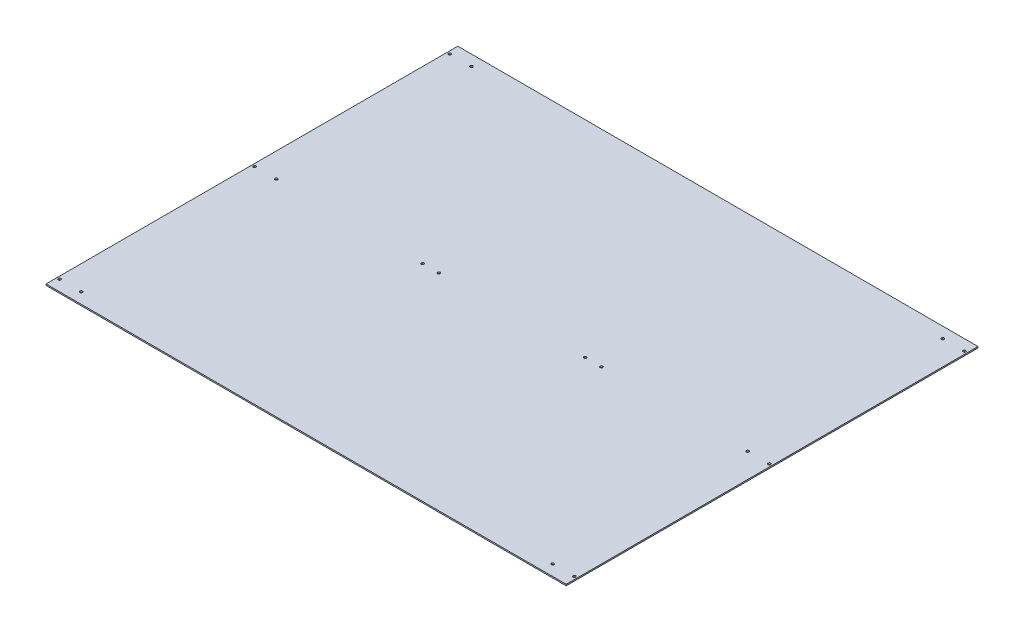
ISO-10303-21;
HEADER;
FILE_DESCRIPTION(('STEP AP214'),'2;1');
FILE_NAME('part.step','',(''),(''),'','','');
FILE_SCHEMA(('AUTOMOTIVE_DESIGN { 1 0 10303 214 1 1 1 1 }'));
ENDSEC;
DATA;
#1=APPLICATION_CONTEXT('core data for automotive mechanical design processes');
#2=APPLICATION_PROTOCOL_DEFINITION('international standard','automotive_design',2000,#1);
#3=PRODUCT_CONTEXT('',#1,'mechanical');
#4=PRODUCT('Part','Part','',(#3));
#5=PRODUCT_RELATED_PRODUCT_CATEGORY('part','',(#4));
#6=PRODUCT_DEFINITION_FORMATION('','',#4);
#7=PRODUCT_DEFINITION_CONTEXT('part definition',#1,'design');
#8=PRODUCT_DEFINITION('design','',#6,#7);
#9=PRODUCT_DEFINITION_SHAPE('','',#8);
#10=(LENGTH_UNIT() NAMED_UNIT(*) SI_UNIT(.MILLI.,.METRE.));
#11=(NAMED_UNIT(*) PLANE_ANGLE_UNIT() SI_UNIT($,.RADIAN.));
#12=(NAMED_UNIT(*) SI_UNIT($,.STERADIAN.) SOLID_ANGLE_UNIT());
#13=UNCERTAINTY_MEASURE_WITH_UNIT(LENGTH_MEASURE(1.E-05),#10,'distance_accuracy_value','');
#14=(GEOMETRIC_REPRESENTATION_CONTEXT(3) GLOBAL_UNCERTAINTY_ASSIGNED_CONTEXT((#13)) GLOBAL_UNIT_ASSIGNED_CONTEXT((#10,
#11,#12)) REPRESENTATION_CONTEXT('',''));
#15=CARTESIAN_POINT('',(0.,0.,0.));
#16=DIRECTION('',(0.,0.,1.));
#17=DIRECTION('',(1.,0.,0.));
#18=AXIS2_PLACEMENT_3D('',#15,#16,#17);
#19=CARTESIAN_POINT('',(0.,-19.05,873.125));
#20=DIRECTION('',(0.,1.,0.));
#21=DIRECTION('',(0.,0.,1.));
#22=AXIS2_PLACEMENT_3D('',#19,#20,#21);
#23=PLANE('',#22);
#24=CARTESIAN_POINT('',(171.45,-19.05,876.3));
#25=DIRECTION('',(0.,1.,0.));
#26=DIRECTION('',(0.,0.,1.));
#27=AXIS2_PLACEMENT_3D('',#24,#25,#26);
#28=CIRCLE('',#27,3.175);
#29=CARTESIAN_POINT('',(171.45,-19.05,879.475));
#30=VERTEX_POINT('',#29);
#31=EDGE_CURVE('E20',#30,#30,#28,.F.);
#32=ORIENTED_EDGE('',*,*,#31,.T.);
#33=EDGE_LOOP('',(#32));
#34=FACE_BOUND('',#33,.T.);
#35=CARTESIAN_POINT('',(-603.25,-19.05,876.3));
#36=DIRECTION('',(0.,-1.,0.));
#37=DIRECTION('',(0.,0.,-1.));
#38=AXIS2_PLACEMENT_3D('',#35,#36,#37);
#39=CIRCLE('',#38,3.175);
#40=CARTESIAN_POINT('',(-603.25,-19.05,873.125));
#41=VERTEX_POINT('',#40);
#42=EDGE_CURVE('E156',#41,#41,#39,.T.);
#43=ORIENTED_EDGE('',*,*,#42,.T.);
#44=EDGE_LOOP('',(#43));
#45=FACE_BOUND('',#44,.T.);
#46=CARTESIAN_POINT('',(-552.45,-19.05,1333.5));
#47=DIRECTION('',(0.,-1.,0.));
#48=DIRECTION('',(0.,0.,-1.));
#49=AXIS2_PLACEMENT_3D('',#46,#47,#48);
#50=CIRCLE('',#49,3.175);
#51=CARTESIAN_POINT('',(-552.45,-19.05,1330.325));
#52=VERTEX_POINT('',#51);
#53=EDGE_CURVE('E168',#52,#52,#50,.T.);
#54=ORIENTED_EDGE('',*,*,#53,.T.);
#55=EDGE_LOOP('',(#54));
#56=FACE_BOUND('',#55,.T.);
#57=CARTESIAN_POINT('',(552.45,-19.05,419.1));
#58=DIRECTION('',(0.,-1.,0.));
#59=DIRECTION('',(0.,0.,-1.));
#60=AXIS2_PLACEMENT_3D('',#57,#58,#59);
#61=CIRCLE('',#60,3.175);
#62=CARTESIAN_POINT('',(552.45,-19.05,415.925));
#63=VERTEX_POINT('',#62);
#64=EDGE_CURVE('E175',#63,#63,#61,.T.);
#65=ORIENTED_EDGE('',*,*,#64,.T.);
#66=EDGE_LOOP('',(#65));
#67=FACE_BOUND('',#66,.T.);
#68=CARTESIAN_POINT('',(552.45,-19.05,876.3));
#69=DIRECTION('',(0.,-1.,0.));
#70=DIRECTION('',(0.,0.,-1.));
#71=AXIS2_PLACEMENT_3D('',#68,#69,#70);
#72=CIRCLE('',#71,3.175);
#73=CARTESIAN_POINT('',(552.45,-19.05,873.125));
#74=VERTEX_POINT('',#73);
#75=EDGE_CURVE('E208',#74,#74,#72,.T.);
#76=ORIENTED_EDGE('',*,*,#75,.T.);
#77=EDGE_LOOP('',(#76));
#78=FACE_BOUND('',#77,.T.);
#79=CARTESIAN_POINT('',(603.25,-19.05,876.3));
#80=DIRECTION('',(0.,-1.,0.));
#81=DIRECTION('',(0.,0.,-1.));
#82=AXIS2_PLACEMENT_3D('',#79,#80,#81);
#83=CIRCLE('',#82,3.175);
#84=CARTESIAN_POINT('',(603.25,-19.05,873.125));
#85=VERTEX_POINT('',#84);
#86=EDGE_CURVE('E204',#85,#85,#83,.T.);
#87=ORIENTED_EDGE('',*,*,#86,.T.);
#88=EDGE_LOOP('',(#87));
#89=FACE_BOUND('',#88,.T.);
#90=CARTESIAN_POINT('',(603.25,-19.05,1333.5));
#91=DIRECTION('',(0.,-1.,0.));
#92=DIRECTION('',(0.,0.,-1.));
#93=AXIS2_PLACEMENT_3D('',#90,#91,#92);
#94=CIRCLE('',#93,3.175);
#95=CARTESIAN_POINT('',(603.25,-19.05,1330.325));
#96=VERTEX_POINT('',#95);
#97=EDGE_CURVE('E201',#96,#96,#94,.T.);
#98=ORIENTED_EDGE('',*,*,#97,.T.);
#99=EDGE_LOOP('',(#98));
#100=FACE_BOUND('',#99,.T.);
#101=CARTESIAN_POINT('',(-552.45,-19.05,419.1));
#102=DIRECTION('',(0.,-1.,0.));
#103=DIRECTION('',(0.,0.,-1.));
#104=AXIS2_PLACEMENT_3D('',#101,#102,#103);
#105=CIRCLE('',#104,3.175);
#106=CARTESIAN_POINT('',(-552.45,-19.05,415.925));
#107=VERTEX_POINT('',#106);
#108=EDGE_CURVE('E194',#107,#107,#105,.T.);
#109=ORIENTED_EDGE('',*,*,#108,.T.);
#110=EDGE_LOOP('',(#109));
#111=FACE_BOUND('',#110,.T.);
#112=CARTESIAN_POINT('',(-603.25,-19.05,419.1));
#113=DIRECTION('',(0.,-1.,0.));
#114=DIRECTION('',(0.,0.,-1.));
#115=AXIS2_PLACEMENT_3D('',#112,#113,#114);
#116=CIRCLE('',#115,3.175);
#117=CARTESIAN_POINT('',(-603.25,-19.05,415.925));
#118=VERTEX_POINT('',#117);
#119=EDGE_CURVE('E190',#118,#118,#116,.T.);
#120=ORIENTED_EDGE('',*,*,#119,.T.);
#121=EDGE_LOOP('',(#120));
#122=FACE_BOUND('',#121,.T.);
#123=DIRECTION('',(0.,0.,1.));
#124=VECTOR('',#123,1.);
#125=CARTESIAN_POINT('',(-609.6,-19.05,838.2));
#126=LINE('',#125,#124);
#127=CARTESIAN_POINT('',(-609.6,-19.05,1358.9));
#128=VERTEX_POINT('',#127);
#129=CARTESIAN_POINT('',(-609.6,-19.05,393.7));
#130=VERTEX_POINT('',#129);
#131=EDGE_CURVE('E59',#128,#130,#126,.F.);
#132=ORIENTED_EDGE('',*,*,#131,.F.);
#133=DIRECTION('',(1.,0.,0.));
#134=VECTOR('',#133,1.);
#135=CARTESIAN_POINT('',(609.6,-19.05,1358.9));
#136=LINE('',#135,#134);
#137=CARTESIAN_POINT('',(609.6,-19.05,1358.9));
#138=VERTEX_POINT('',#137);
#139=EDGE_CURVE('E54',#138,#128,#136,.F.);
#140=ORIENTED_EDGE('',*,*,#139,.F.);
#141=DIRECTION('',(0.,0.,1.));
#142=VECTOR('',#141,1.);
#143=CARTESIAN_POINT('',(609.6,-19.05,838.2));
#144=LINE('',#143,#142);
#145=CARTESIAN_POINT('',(609.6,-19.05,393.7));
#146=VERTEX_POINT('',#145);
#147=EDGE_CURVE('E72',#138,#146,#144,.F.);
#148=ORIENTED_EDGE('',*,*,#147,.T.);
#149=DIRECTION('',(-1.,0.,0.));
#150=VECTOR('',#149,1.);
#151=CARTESIAN_POINT('',(410.172683035578,-19.05,393.7));
#152=LINE('',#151,#150);
#153=EDGE_CURVE('E68',#130,#146,#152,.F.);
#154=ORIENTED_EDGE('',*,*,#153,.F.);
#155=EDGE_LOOP('',(#132,#140,#148,#154));
#156=FACE_BOUND('',#155,.T.);
#157=CARTESIAN_POINT('',(552.45,-19.05,1333.5));
#158=DIRECTION('',(0.,-1.,0.));
#159=DIRECTION('',(0.,0.,-1.));
#160=AXIS2_PLACEMENT_3D('',#157,#158,#159);
#161=CIRCLE('',#160,3.175);
#162=CARTESIAN_POINT('',(552.45,-19.05,1330.325));
#163=VERTEX_POINT('',#162);
#164=EDGE_CURVE('E76',#163,#163,#161,.T.);
#165=ORIENTED_EDGE('',*,*,#164,.T.);
#166=EDGE_LOOP('',(#165));
#167=FACE_BOUND('',#166,.T.);
#168=CARTESIAN_POINT('',(-552.45,-19.05,876.3));
#169=DIRECTION('',(0.,-1.,0.));
#170=DIRECTION('',(0.,0.,-1.));
#171=AXIS2_PLACEMENT_3D('',#168,#169,#170);
#172=CIRCLE('',#171,3.175);
#173=CARTESIAN_POINT('',(-552.45,-19.05,873.125));
#174=VERTEX_POINT('',#173);
#175=EDGE_CURVE('E183',#174,#174,#172,.T.);
#176=ORIENTED_EDGE('',*,*,#175,.T.);
#177=EDGE_LOOP('',(#176));
#178=FACE_BOUND('',#177,.T.);
#179=CARTESIAN_POINT('',(603.25,-19.05,419.1));
#180=DIRECTION('',(0.,-1.,0.));
#181=DIRECTION('',(0.,0.,-1.));
#182=AXIS2_PLACEMENT_3D('',#179,#180,#181);
#183=CIRCLE('',#182,3.175);
#184=CARTESIAN_POINT('',(603.25,-19.05,415.925));
#185=VERTEX_POINT('',#184);
#186=EDGE_CURVE('E172',#185,#185,#183,.T.);
#187=ORIENTED_EDGE('',*,*,#186,.T.);
#188=EDGE_LOOP('',(#187));
#189=FACE_BOUND('',#188,.T.);
#190=CARTESIAN_POINT('',(-603.25,-19.05,1333.5));
#191=DIRECTION('',(0.,-1.,0.));
#192=DIRECTION('',(0.,0.,-1.));
#193=AXIS2_PLACEMENT_3D('',#190,#191,#192);
#194=CIRCLE('',#193,3.175);
#195=CARTESIAN_POINT('',(-603.25,-19.05,1330.325));
#196=VERTEX_POINT('',#195);
#197=EDGE_CURVE('E160',#196,#196,#194,.T.);
#198=ORIENTED_EDGE('',*,*,#197,.T.);
#199=EDGE_LOOP('',(#198));
#200=FACE_BOUND('',#199,.T.);
#201=CARTESIAN_POINT('',(-209.55,-19.05,876.3));
#202=DIRECTION('',(0.,1.,0.));
#203=DIRECTION('',(0.,0.,1.));
#204=AXIS2_PLACEMENT_3D('',#201,#202,#203);
#205=CIRCLE('',#204,3.175);
#206=CARTESIAN_POINT('',(-209.55,-19.05,879.475));
#207=VERTEX_POINT('',#206);
#208=EDGE_CURVE('E153',#207,#207,#205,.F.);
#209=ORIENTED_EDGE('',*,*,#208,.T.);
#210=EDGE_LOOP('',(#209));
#211=FACE_BOUND('',#210,.T.);
#212=CARTESIAN_POINT('',(-171.45,-19.05,876.3));
#213=DIRECTION('',(0.,1.,0.));
#214=DIRECTION('',(0.,0.,1.));
#215=AXIS2_PLACEMENT_3D('',#212,#213,#214);
#216=CIRCLE('',#215,3.175);
#217=CARTESIAN_POINT('',(-171.45,-19.05,879.475));
#218=VERTEX_POINT('',#217);
#219=EDGE_CURVE('E150',#218,#218,#216,.F.);
#220=ORIENTED_EDGE('',*,*,#219,.T.);
#221=EDGE_LOOP('',(#220));
#222=FACE_BOUND('',#221,.T.);
#223=CARTESIAN_POINT('',(209.55,-19.05,876.3));
#224=DIRECTION('',(0.,1.,0.));
#225=DIRECTION('',(0.,0.,1.));
#226=AXIS2_PLACEMENT_3D('',#223,#224,#225);
#227=CIRCLE('',#226,3.175);
#228=CARTESIAN_POINT('',(209.55,-19.05,879.475));
#229=VERTEX_POINT('',#228);
#230=EDGE_CURVE('E211',#229,#229,#227,.F.);
#231=ORIENTED_EDGE('',*,*,#230,.T.);
#232=EDGE_LOOP('',(#231));
#233=FACE_BOUND('',#232,.T.);
#234=ADVANCED_FACE('F17',(#34,#45,#56,#67,#78,#89,#100,#111,#122,#156,#167,#178,#189,#200,#211,
#222,#233),#23,.T.);
#235=CARTESIAN_POINT('',(171.45,3.175,876.3));
#236=DIRECTION('',(0.,1.,0.));
#237=DIRECTION('',(0.,0.,1.));
#238=AXIS2_PLACEMENT_3D('',#235,#236,#237);
#239=CYLINDRICAL_SURFACE('',#238,3.175);
#240=CARTESIAN_POINT('',(171.45,-22.225,876.3));
#241=DIRECTION('',(0.,1.,0.));
#242=DIRECTION('',(0.,0.,1.));
#243=AXIS2_PLACEMENT_3D('',#240,#241,#242);
#244=CIRCLE('',#243,3.175);
#245=CARTESIAN_POINT('',(171.45,-22.225,879.475));
#246=VERTEX_POINT('',#245);
#247=EDGE_CURVE('E147',#246,#246,#244,.F.);
#248=ORIENTED_EDGE('',*,*,#247,.T.);
#249=EDGE_LOOP('',(#248));
#250=FACE_BOUND('',#249,.T.);
#251=ORIENTED_EDGE('',*,*,#31,.F.);
#252=EDGE_LOOP('',(#251));
#253=FACE_BOUND('',#252,.T.);
#254=ADVANCED_FACE('F220',(#250,#253),#239,.F.);
#255=CARTESIAN_POINT('',(209.55,3.175,876.3));
#256=DIRECTION('',(0.,1.,0.));
#257=DIRECTION('',(0.,0.,1.));
#258=AXIS2_PLACEMENT_3D('',#255,#256,#257);
#259=CYLINDRICAL_SURFACE('',#258,3.175);
#260=CARTESIAN_POINT('',(209.55,-22.225,876.3));
#261=DIRECTION('',(0.,1.,0.));
#262=DIRECTION('',(0.,0.,1.));
#263=AXIS2_PLACEMENT_3D('',#260,#261,#262);
#264=CIRCLE('',#263,3.175);
#265=CARTESIAN_POINT('',(209.55,-22.225,879.475));
#266=VERTEX_POINT('',#265);
#267=EDGE_CURVE('E144',#266,#266,#264,.F.);
#268=ORIENTED_EDGE('',*,*,#267,.T.);
#269=EDGE_LOOP('',(#268));
#270=FACE_BOUND('',#269,.T.);
#271=ORIENTED_EDGE('',*,*,#230,.F.);
#272=EDGE_LOOP('',(#271));
#273=FACE_BOUND('',#272,.T.);
#274=ADVANCED_FACE('F222',(#270,#273),#259,.F.);
#275=CARTESIAN_POINT('',(552.45,-44.45,876.3));
#276=DIRECTION('',(0.,-1.,0.));
#277=DIRECTION('',(0.,0.,-1.));
#278=AXIS2_PLACEMENT_3D('',#275,#276,#277);
#279=CYLINDRICAL_SURFACE('',#278,3.175);
#280=CARTESIAN_POINT('',(552.45,-22.225,876.3));
#281=DIRECTION('',(0.,-1.,0.));
#282=DIRECTION('',(0.,0.,-1.));
#283=AXIS2_PLACEMENT_3D('',#280,#281,#282);
#284=CIRCLE('',#283,3.175);
#285=CARTESIAN_POINT('',(552.45,-22.225,873.125));
#286=VERTEX_POINT('',#285);
#287=EDGE_CURVE('E140',#286,#286,#284,.T.);
#288=ORIENTED_EDGE('',*,*,#287,.T.);
#289=EDGE_LOOP('',(#288));
#290=FACE_BOUND('',#289,.T.);
#291=ORIENTED_EDGE('',*,*,#75,.F.);
#292=EDGE_LOOP('',(#291));
#293=FACE_BOUND('',#292,.T.);
#294=ADVANCED_FACE('F229',(#290,#293),#279,.F.);
#295=CARTESIAN_POINT('',(603.25,-44.45,876.3));
#296=DIRECTION('',(0.,-1.,0.));
#297=DIRECTION('',(0.,0.,-1.));
#298=AXIS2_PLACEMENT_3D('',#295,#296,#297);
#299=CYLINDRICAL_SURFACE('',#298,3.175);
#300=CARTESIAN_POINT('',(603.25,-22.225,876.3));
#301=DIRECTION('',(0.,-1.,0.));
#302=DIRECTION('',(0.,0.,-1.));
#303=AXIS2_PLACEMENT_3D('',#300,#301,#302);
#304=CIRCLE('',#303,3.175);
#305=CARTESIAN_POINT('',(603.25,-22.225,873.125));
#306=VERTEX_POINT('',#305);
#307=EDGE_CURVE('E137',#306,#306,#304,.T.);
#308=ORIENTED_EDGE('',*,*,#307,.T.);
#309=EDGE_LOOP('',(#308));
#310=FACE_BOUND('',#309,.T.);
#311=ORIENTED_EDGE('',*,*,#86,.F.);
#312=EDGE_LOOP('',(#311));
#313=FACE_BOUND('',#312,.T.);
#314=ADVANCED_FACE('F298',(#310,#313),#299,.F.);
#315=CARTESIAN_POINT('',(603.25,-44.45,1333.5));
#316=DIRECTION('',(0.,-1.,0.));
#317=DIRECTION('',(0.,0.,-1.));
#318=AXIS2_PLACEMENT_3D('',#315,#316,#317);
#319=CYLINDRICAL_SURFACE('',#318,3.175);
#320=CARTESIAN_POINT('',(603.25,-22.225,1333.5));
#321=DIRECTION('',(0.,-1.,0.));
#322=DIRECTION('',(0.,0.,-1.));
#323=AXIS2_PLACEMENT_3D('',#320,#321,#322);
#324=CIRCLE('',#323,3.175);
#325=CARTESIAN_POINT('',(603.25,-22.225,1330.325));
#326=VERTEX_POINT('',#325);
#327=EDGE_CURVE('E133',#326,#326,#324,.T.);
#328=ORIENTED_EDGE('',*,*,#327,.T.);
#329=EDGE_LOOP('',(#328));
#330=FACE_BOUND('',#329,.T.);
#331=ORIENTED_EDGE('',*,*,#97,.F.);
#332=EDGE_LOOP('',(#331));
#333=FACE_BOUND('',#332,.T.);
#334=ADVANCED_FACE('F294',(#330,#333),#319,.F.);
#335=CARTESIAN_POINT('',(-552.45,-44.45,419.1));
#336=DIRECTION('',(0.,-1.,0.));
#337=DIRECTION('',(0.,0.,-1.));
#338=AXIS2_PLACEMENT_3D('',#335,#336,#337);
#339=CYLINDRICAL_SURFACE('',#338,3.175);
#340=CARTESIAN_POINT('',(-552.45,-22.225,419.1));
#341=DIRECTION('',(0.,-1.,0.));
#342=DIRECTION('',(0.,0.,-1.));
#343=AXIS2_PLACEMENT_3D('',#340,#341,#342);
#344=CIRCLE('',#343,3.175);
#345=CARTESIAN_POINT('',(-552.45,-22.225,415.925));
#346=VERTEX_POINT('',#345);
#347=EDGE_CURVE('E129',#346,#346,#344,.T.);
#348=ORIENTED_EDGE('',*,*,#347,.T.);
#349=EDGE_LOOP('',(#348));
#350=FACE_BOUND('',#349,.T.);
#351=ORIENTED_EDGE('',*,*,#108,.F.);
#352=EDGE_LOOP('',(#351));
#353=FACE_BOUND('',#352,.T.);
#354=ADVANCED_FACE('F290',(#350,#353),#339,.F.);
#355=CARTESIAN_POINT('',(-603.25,-44.45,419.1));
#356=DIRECTION('',(0.,-1.,0.));
#357=DIRECTION('',(0.,0.,-1.));
#358=AXIS2_PLACEMENT_3D('',#355,#356,#357);
#359=CYLINDRICAL_SURFACE('',#358,3.175);
#360=CARTESIAN_POINT('',(-603.25,-22.225,419.1));
#361=DIRECTION('',(0.,-1.,0.));
#362=DIRECTION('',(0.,0.,-1.));
#363=AXIS2_PLACEMENT_3D('',#360,#361,#362);
#364=CIRCLE('',#363,3.175);
#365=CARTESIAN_POINT('',(-603.25,-22.225,415.925));
#366=VERTEX_POINT('',#365);
#367=EDGE_CURVE('E125',#366,#366,#364,.T.);
#368=ORIENTED_EDGE('',*,*,#367,.T.);
#369=EDGE_LOOP('',(#368));
#370=FACE_BOUND('',#369,.T.);
#371=ORIENTED_EDGE('',*,*,#119,.F.);
#372=EDGE_LOOP('',(#371));
#373=FACE_BOUND('',#372,.T.);
#374=ADVANCED_FACE('F286',(#370,#373),#359,.F.);
#375=CARTESIAN_POINT('',(552.45,-44.45,1333.5));
#376=DIRECTION('',(0.,-1.,0.));
#377=DIRECTION('',(0.,0.,-1.));
#378=AXIS2_PLACEMENT_3D('',#375,#376,#377);
#379=CYLINDRICAL_SURFACE('',#378,3.175);
#380=CARTESIAN_POINT('',(552.45,-22.225,1333.5));
#381=DIRECTION('',(0.,-1.,0.));
#382=DIRECTION('',(0.,0.,-1.));
#383=AXIS2_PLACEMENT_3D('',#380,#381,#382);
#384=CIRCLE('',#383,3.175);
#385=CARTESIAN_POINT('',(552.45,-22.225,1330.325));
#386=VERTEX_POINT('',#385);
#387=EDGE_CURVE('E122',#386,#386,#384,.T.);
#388=ORIENTED_EDGE('',*,*,#387,.T.);
#389=EDGE_LOOP('',(#388));
#390=FACE_BOUND('',#389,.T.);
#391=ORIENTED_EDGE('',*,*,#164,.F.);
#392=EDGE_LOOP('',(#391));
#393=FACE_BOUND('',#392,.T.);
#394=ADVANCED_FACE('F283',(#390,#393),#379,.F.);
#395=CARTESIAN_POINT('',(410.172683035578,-19.05,393.7));
#396=DIRECTION('',(0.,0.,-1.));
#397=DIRECTION('',(-1.,0.,0.));
#398=AXIS2_PLACEMENT_3D('',#395,#396,#397);
#399=PLANE('',#398);
#400=ORIENTED_EDGE('',*,*,#153,.T.);
#401=DIRECTION('',(0.,1.,0.));
#402=VECTOR('',#401,1.);
#403=CARTESIAN_POINT('',(609.6,-19.05,393.7));
#404=LINE('',#403,#402);
#405=CARTESIAN_POINT('',(609.6,-22.225,393.7));
#406=VERTEX_POINT('',#405);
#407=EDGE_CURVE('E186',#146,#406,#404,.F.);
#408=ORIENTED_EDGE('',*,*,#407,.T.);
#409=DIRECTION('',(1.,0.,0.));
#410=VECTOR('',#409,1.);
#411=CARTESIAN_POINT('',(0.,-22.225,393.7));
#412=LINE('',#411,#410);
#413=CARTESIAN_POINT('',(-609.6,-22.225,393.7));
#414=VERTEX_POINT('',#413);
#415=EDGE_CURVE('E80',#406,#414,#412,.F.);
#416=ORIENTED_EDGE('',*,*,#415,.T.);
#417=DIRECTION('',(0.,1.,0.));
#418=VECTOR('',#417,1.);
#419=CARTESIAN_POINT('',(-609.6,-19.05,393.7));
#420=LINE('',#419,#418);
#421=EDGE_CURVE('E64',#130,#414,#420,.F.);
#422=ORIENTED_EDGE('',*,*,#421,.F.);
#423=EDGE_LOOP('',(#400,#408,#416,#422));
#424=FACE_BOUND('',#423,.T.);
#425=ADVANCED_FACE('F79',(#424),#399,.T.);
#426=CARTESIAN_POINT('',(-609.6,-19.05,838.2));
#427=DIRECTION('',(-1.,0.,0.));
#428=DIRECTION('',(0.,0.,1.));
#429=AXIS2_PLACEMENT_3D('',#426,#427,#428);
#430=PLANE('',#429);
#431=ORIENTED_EDGE('',*,*,#131,.T.);
#432=ORIENTED_EDGE('',*,*,#421,.T.);
#433=DIRECTION('',(0.,0.,1.));
#434=VECTOR('',#433,1.);
#435=CARTESIAN_POINT('',(-609.6,-22.225,873.125));
#436=LINE('',#435,#434);
#437=CARTESIAN_POINT('',(-609.6,-22.225,1358.9));
#438=VERTEX_POINT('',#437);
#439=EDGE_CURVE('E502',#414,#438,#436,.T.);
#440=ORIENTED_EDGE('',*,*,#439,.T.);
#441=DIRECTION('',(0.,1.,0.));
#442=VECTOR('',#441,1.);
#443=CARTESIAN_POINT('',(-609.6,-19.05,1358.9));
#444=LINE('',#443,#442);
#445=EDGE_CURVE('E66',#128,#438,#444,.F.);
#446=ORIENTED_EDGE('',*,*,#445,.F.);
#447=EDGE_LOOP('',(#431,#432,#440,#446));
#448=FACE_BOUND('',#447,.T.);
#449=ADVANCED_FACE('F61',(#448),#430,.T.);
#450=CARTESIAN_POINT('',(609.6,-19.05,1358.9));
#451=DIRECTION('',(0.,0.,1.));
#452=DIRECTION('',(1.,0.,0.));
#453=AXIS2_PLACEMENT_3D('',#450,#451,#452);
#454=PLANE('',#453);
#455=ORIENTED_EDGE('',*,*,#139,.T.);
#456=ORIENTED_EDGE('',*,*,#445,.T.);
#457=DIRECTION('',(1.,0.,0.));
#458=VECTOR('',#457,1.);
#459=CARTESIAN_POINT('',(0.,-22.225,1358.9));
#460=LINE('',#459,#458);
#461=CARTESIAN_POINT('',(609.6,-22.225,1358.9));
#462=VERTEX_POINT('',#461);
#463=EDGE_CURVE('E500',#438,#462,#460,.T.);
#464=ORIENTED_EDGE('',*,*,#463,.T.);
#465=DIRECTION('',(0.,1.,0.));
#466=VECTOR('',#465,1.);
#467=CARTESIAN_POINT('',(609.6,-19.05,1358.9));
#468=LINE('',#467,#466);
#469=EDGE_CURVE('E35',#462,#138,#468,.T.);
#470=ORIENTED_EDGE('',*,*,#469,.T.);
#471=EDGE_LOOP('',(#455,#456,#464,#470));
#472=FACE_BOUND('',#471,.T.);
#473=ADVANCED_FACE('F276',(#472),#454,.T.);
#474=CARTESIAN_POINT('',(609.6,-19.05,838.2));
#475=DIRECTION('',(-1.,0.,0.));
#476=DIRECTION('',(0.,0.,1.));
#477=AXIS2_PLACEMENT_3D('',#474,#475,#476);
#478=PLANE('',#477);
#479=ORIENTED_EDGE('',*,*,#407,.F.);
#480=ORIENTED_EDGE('',*,*,#147,.F.);
#481=ORIENTED_EDGE('',*,*,#469,.F.);
#482=DIRECTION('',(0.,0.,1.));
#483=VECTOR('',#482,1.);
#484=CARTESIAN_POINT('',(609.6,-22.225,873.125));
#485=LINE('',#484,#483);
#486=EDGE_CURVE('E492',#462,#406,#485,.F.);
#487=ORIENTED_EDGE('',*,*,#486,.T.);
#488=EDGE_LOOP('',(#479,#480,#481,#487));
#489=FACE_BOUND('',#488,.T.);
#490=ADVANCED_FACE('F272',(#489),#478,.F.);
#491=CARTESIAN_POINT('',(-552.45,-44.45,876.3));
#492=DIRECTION('',(0.,-1.,0.));
#493=DIRECTION('',(0.,0.,-1.));
#494=AXIS2_PLACEMENT_3D('',#491,#492,#493);
#495=CYLINDRICAL_SURFACE('',#494,3.175);
#496=CARTESIAN_POINT('',(-552.45,-22.225,876.3));
#497=DIRECTION('',(0.,-1.,0.));
#498=DIRECTION('',(0.,0.,-1.));
#499=AXIS2_PLACEMENT_3D('',#496,#497,#498);
#500=CIRCLE('',#499,3.175);
#501=CARTESIAN_POINT('',(-552.45,-22.225,873.125));
#502=VERTEX_POINT('',#501);
#503=EDGE_CURVE('E114',#502,#502,#500,.T.);
#504=ORIENTED_EDGE('',*,*,#503,.T.);
#505=EDGE_LOOP('',(#504));
#506=FACE_BOUND('',#505,.T.);
#507=ORIENTED_EDGE('',*,*,#175,.F.);
#508=EDGE_LOOP('',(#507));
#509=FACE_BOUND('',#508,.T.);
#510=ADVANCED_FACE('F268',(#506,#509),#495,.F.);
#511=CARTESIAN_POINT('',(552.45,-44.45,419.1));
#512=DIRECTION('',(0.,-1.,0.));
#513=DIRECTION('',(0.,0.,-1.));
#514=AXIS2_PLACEMENT_3D('',#511,#512,#513);
#515=CYLINDRICAL_SURFACE('',#514,3.175);
#516=CARTESIAN_POINT('',(552.45,-22.225,419.1));
#517=DIRECTION('',(0.,-1.,0.));
#518=DIRECTION('',(0.,0.,-1.));
#519=AXIS2_PLACEMENT_3D('',#516,#517,#518);
#520=CIRCLE('',#519,3.175);
#521=CARTESIAN_POINT('',(552.45,-22.225,415.925));
#522=VERTEX_POINT('',#521);
#523=EDGE_CURVE('E110',#522,#522,#520,.T.);
#524=ORIENTED_EDGE('',*,*,#523,.T.);
#525=EDGE_LOOP('',(#524));
#526=FACE_BOUND('',#525,.T.);
#527=ORIENTED_EDGE('',*,*,#64,.F.);
#528=EDGE_LOOP('',(#527));
#529=FACE_BOUND('',#528,.T.);
#530=ADVANCED_FACE('F264',(#526,#529),#515,.F.);
#531=CARTESIAN_POINT('',(603.25,-44.45,419.1));
#532=DIRECTION('',(0.,-1.,0.));
#533=DIRECTION('',(0.,0.,-1.));
#534=AXIS2_PLACEMENT_3D('',#531,#532,#533);
#535=CYLINDRICAL_SURFACE('',#534,3.175);
#536=CARTESIAN_POINT('',(603.25,-22.225,419.1));
#537=DIRECTION('',(0.,-1.,0.));
#538=DIRECTION('',(0.,0.,-1.));
#539=AXIS2_PLACEMENT_3D('',#536,#537,#538);
#540=CIRCLE('',#539,3.175);
#541=CARTESIAN_POINT('',(603.25,-22.225,415.925));
#542=VERTEX_POINT('',#541);
#543=EDGE_CURVE('E106',#542,#542,#540,.T.);
#544=ORIENTED_EDGE('',*,*,#543,.T.);
#545=EDGE_LOOP('',(#544));
#546=FACE_BOUND('',#545,.T.);
#547=ORIENTED_EDGE('',*,*,#186,.F.);
#548=EDGE_LOOP('',(#547));
#549=FACE_BOUND('',#548,.T.);
#550=ADVANCED_FACE('F260',(#546,#549),#535,.F.);
#551=CARTESIAN_POINT('',(-552.45,-44.45,1333.5));
#552=DIRECTION('',(0.,-1.,0.));
#553=DIRECTION('',(0.,0.,-1.));
#554=AXIS2_PLACEMENT_3D('',#551,#552,#553);
#555=CYLINDRICAL_SURFACE('',#554,3.175);
#556=CARTESIAN_POINT('',(-552.45,-22.225,1333.5));
#557=DIRECTION('',(0.,-1.,0.));
#558=DIRECTION('',(0.,0.,-1.));
#559=AXIS2_PLACEMENT_3D('',#556,#557,#558);
#560=CIRCLE('',#559,3.175);
#561=CARTESIAN_POINT('',(-552.45,-22.225,1330.325));
#562=VERTEX_POINT('',#561);
#563=EDGE_CURVE('E103',#562,#562,#560,.T.);
#564=ORIENTED_EDGE('',*,*,#563,.T.);
#565=EDGE_LOOP('',(#564));
#566=FACE_BOUND('',#565,.T.);
#567=ORIENTED_EDGE('',*,*,#53,.F.);
#568=EDGE_LOOP('',(#567));
#569=FACE_BOUND('',#568,.T.);
#570=ADVANCED_FACE('F256',(#566,#569),#555,.F.);
#571=CARTESIAN_POINT('',(-603.25,-44.45,1333.5));
#572=DIRECTION('',(0.,-1.,0.));
#573=DIRECTION('',(0.,0.,-1.));
#574=AXIS2_PLACEMENT_3D('',#571,#572,#573);
#575=CYLINDRICAL_SURFACE('',#574,3.175);
#576=CARTESIAN_POINT('',(-603.25,-22.225,1333.5));
#577=DIRECTION('',(0.,-1.,0.));
#578=DIRECTION('',(0.,0.,-1.));
#579=AXIS2_PLACEMENT_3D('',#576,#577,#578);
#580=CIRCLE('',#579,3.175);
#581=CARTESIAN_POINT('',(-603.25,-22.225,1330.325));
#582=VERTEX_POINT('',#581);
#583=EDGE_CURVE('E91',#582,#582,#580,.T.);
#584=ORIENTED_EDGE('',*,*,#583,.T.);
#585=EDGE_LOOP('',(#584));
#586=FACE_BOUND('',#585,.T.);
#587=ORIENTED_EDGE('',*,*,#197,.F.);
#588=EDGE_LOOP('',(#587));
#589=FACE_BOUND('',#588,.T.);
#590=ADVANCED_FACE('F252',(#586,#589),#575,.F.);
#591=CARTESIAN_POINT('',(-603.25,-44.45,876.3));
#592=DIRECTION('',(0.,-1.,0.));
#593=DIRECTION('',(0.,0.,-1.));
#594=AXIS2_PLACEMENT_3D('',#591,#592,#593);
#595=CYLINDRICAL_SURFACE('',#594,3.175);
#596=CARTESIAN_POINT('',(-603.25,-22.225,876.3));
#597=DIRECTION('',(0.,-1.,0.));
#598=DIRECTION('',(0.,0.,-1.));
#599=AXIS2_PLACEMENT_3D('',#596,#597,#598);
#600=CIRCLE('',#599,3.175);
#601=CARTESIAN_POINT('',(-603.25,-22.225,873.125));
#602=VERTEX_POINT('',#601);
#603=EDGE_CURVE('E87',#602,#602,#600,.T.);
#604=ORIENTED_EDGE('',*,*,#603,.T.);
#605=EDGE_LOOP('',(#604));
#606=FACE_BOUND('',#605,.T.);
#607=ORIENTED_EDGE('',*,*,#42,.F.);
#608=EDGE_LOOP('',(#607));
#609=FACE_BOUND('',#608,.T.);
#610=ADVANCED_FACE('F248',(#606,#609),#595,.F.);
#611=CARTESIAN_POINT('',(-209.55,3.175,876.3));
#612=DIRECTION('',(0.,1.,0.));
#613=DIRECTION('',(0.,0.,1.));
#614=AXIS2_PLACEMENT_3D('',#611,#612,#613);
#615=CYLINDRICAL_SURFACE('',#614,3.175);
#616=CARTESIAN_POINT('',(-209.55,-22.225,876.3));
#617=DIRECTION('',(0.,1.,0.));
#618=DIRECTION('',(0.,0.,1.));
#619=AXIS2_PLACEMENT_3D('',#616,#617,#618);
#620=CIRCLE('',#619,3.175);
#621=CARTESIAN_POINT('',(-209.55,-22.225,879.475));
#622=VERTEX_POINT('',#621);
#623=EDGE_CURVE('E26',#622,#622,#620,.F.);
#624=ORIENTED_EDGE('',*,*,#623,.T.);
#625=EDGE_LOOP('',(#624));
#626=FACE_BOUND('',#625,.T.);
#627=ORIENTED_EDGE('',*,*,#208,.F.);
#628=EDGE_LOOP('',(#627));
#629=FACE_BOUND('',#628,.T.);
#630=ADVANCED_FACE('F240',(#626,#629),#615,.F.);
#631=CARTESIAN_POINT('',(-171.45,3.175,876.3));
#632=DIRECTION('',(0.,1.,0.));
#633=DIRECTION('',(0.,0.,1.));
#634=AXIS2_PLACEMENT_3D('',#631,#632,#633);
#635=CYLINDRICAL_SURFACE('',#634,3.175);
#636=CARTESIAN_POINT('',(-171.45,-22.225,876.3));
#637=DIRECTION('',(0.,1.,0.));
#638=DIRECTION('',(0.,0.,1.));
#639=AXIS2_PLACEMENT_3D('',#636,#637,#638);
#640=CIRCLE('',#639,3.175);
#641=CARTESIAN_POINT('',(-171.45,-22.225,879.475));
#642=VERTEX_POINT('',#641);
#643=EDGE_CURVE('E10',#642,#642,#640,.F.);
#644=ORIENTED_EDGE('',*,*,#643,.T.);
#645=EDGE_LOOP('',(#644));
#646=FACE_BOUND('',#645,.T.);
#647=ORIENTED_EDGE('',*,*,#219,.F.);
#648=EDGE_LOOP('',(#647));
#649=FACE_BOUND('',#648,.T.);
#650=ADVANCED_FACE('F234',(#646,#649),#635,.F.);
#651=CARTESIAN_POINT('',(0.,-22.225,873.125));
#652=DIRECTION('',(0.,1.,0.));
#653=DIRECTION('',(0.,0.,1.));
#654=AXIS2_PLACEMENT_3D('',#651,#652,#653);
#655=PLANE('',#654);
#656=ORIENTED_EDGE('',*,*,#643,.F.);
#657=EDGE_LOOP('',(#656));
#658=FACE_BOUND('',#657,.T.);
#659=ORIENTED_EDGE('',*,*,#623,.F.);
#660=EDGE_LOOP('',(#659));
#661=FACE_BOUND('',#660,.T.);
#662=ORIENTED_EDGE('',*,*,#603,.F.);
#663=EDGE_LOOP('',(#662));
#664=FACE_BOUND('',#663,.T.);
#665=ORIENTED_EDGE('',*,*,#583,.F.);
#666=EDGE_LOOP('',(#665));
#667=FACE_BOUND('',#666,.T.);
#668=ORIENTED_EDGE('',*,*,#563,.F.);
#669=EDGE_LOOP('',(#668));
#670=FACE_BOUND('',#669,.T.);
#671=ORIENTED_EDGE('',*,*,#543,.F.);
#672=EDGE_LOOP('',(#671));
#673=FACE_BOUND('',#672,.T.);
#674=ORIENTED_EDGE('',*,*,#523,.F.);
#675=EDGE_LOOP('',(#674));
#676=FACE_BOUND('',#675,.T.);
#677=ORIENTED_EDGE('',*,*,#503,.F.);
#678=EDGE_LOOP('',(#677));
#679=FACE_BOUND('',#678,.T.);
#680=ORIENTED_EDGE('',*,*,#463,.F.);
#681=ORIENTED_EDGE('',*,*,#439,.F.);
#682=ORIENTED_EDGE('',*,*,#415,.F.);
#683=ORIENTED_EDGE('',*,*,#486,.F.);
#684=EDGE_LOOP('',(#680,#681,#682,#683));
#685=FACE_BOUND('',#684,.T.);
#686=ORIENTED_EDGE('',*,*,#387,.F.);
#687=EDGE_LOOP('',(#686));
#688=FACE_BOUND('',#687,.T.);
#689=ORIENTED_EDGE('',*,*,#367,.F.);
#690=EDGE_LOOP('',(#689));
#691=FACE_BOUND('',#690,.T.);
#692=ORIENTED_EDGE('',*,*,#347,.F.);
#693=EDGE_LOOP('',(#692));
#694=FACE_BOUND('',#693,.T.);
#695=ORIENTED_EDGE('',*,*,#327,.F.);
#696=EDGE_LOOP('',(#695));
#697=FACE_BOUND('',#696,.T.);
#698=ORIENTED_EDGE('',*,*,#307,.F.);
#699=EDGE_LOOP('',(#698));
#700=FACE_BOUND('',#699,.T.);
#701=ORIENTED_EDGE('',*,*,#287,.F.);
#702=EDGE_LOOP('',(#701));
#703=FACE_BOUND('',#702,.T.);
#704=ORIENTED_EDGE('',*,*,#267,.F.);
#705=EDGE_LOOP('',(#704));
#706=FACE_BOUND('',#705,.T.);
#707=ORIENTED_EDGE('',*,*,#247,.F.);
#708=EDGE_LOOP('',(#707));
#709=FACE_BOUND('',#708,.T.);
#710=ADVANCED_FACE('F232',(#658,#661,#664,#667,#670,#673,#676,#679,#685,#688,#691,#694,#697,
#700,#703,#706,#709),#655,.F.);
#711=CLOSED_SHELL('',(#234,#254,#274,#294,#314,#334,#354,#374,#394,#425,#449,#473,#490,#510,
#530,#550,#570,#590,#610,#630,#650,#710));
#712=MANIFOLD_SOLID_BREP('B1',#711);
#713=ADVANCED_BREP_SHAPE_REPRESENTATION('',(#18,#712),#14);
#714=SHAPE_DEFINITION_REPRESENTATION(#9,#713);
ENDSEC;
END-ISO-10303-21;
